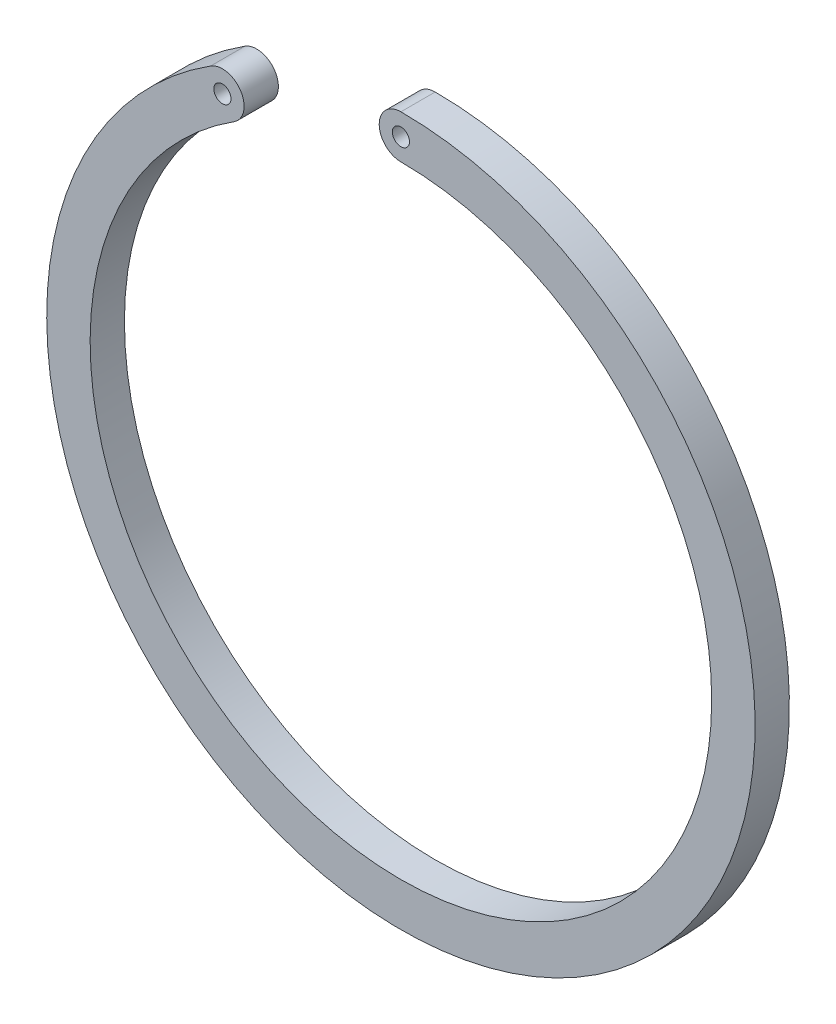
ISO-10303-21;
HEADER;
FILE_DESCRIPTION(('STEP AP214'),'2;1');
FILE_NAME('part.step','',(''),(''),'','','');
FILE_SCHEMA(('AUTOMOTIVE_DESIGN { 1 0 10303 214 1 1 1 1 }'));
ENDSEC;
DATA;
#1=APPLICATION_CONTEXT('core data for automotive mechanical design processes');
#2=APPLICATION_PROTOCOL_DEFINITION('international standard','automotive_design',2000,#1);
#3=PRODUCT_CONTEXT('',#1,'mechanical');
#4=PRODUCT('Part','Part','',(#3));
#5=PRODUCT_RELATED_PRODUCT_CATEGORY('part','',(#4));
#6=PRODUCT_DEFINITION_FORMATION('','',#4);
#7=PRODUCT_DEFINITION_CONTEXT('part definition',#1,'design');
#8=PRODUCT_DEFINITION('design','',#6,#7);
#9=PRODUCT_DEFINITION_SHAPE('','',#8);
#10=(LENGTH_UNIT() NAMED_UNIT(*) SI_UNIT(.MILLI.,.METRE.));
#11=(NAMED_UNIT(*) PLANE_ANGLE_UNIT() SI_UNIT($,.RADIAN.));
#12=(NAMED_UNIT(*) SI_UNIT($,.STERADIAN.) SOLID_ANGLE_UNIT());
#13=UNCERTAINTY_MEASURE_WITH_UNIT(LENGTH_MEASURE(1.E-05),#10,'distance_accuracy_value','');
#14=(GEOMETRIC_REPRESENTATION_CONTEXT(3) GLOBAL_UNCERTAINTY_ASSIGNED_CONTEXT((#13)) GLOBAL_UNIT_ASSIGNED_CONTEXT((#10,
#11,#12)) REPRESENTATION_CONTEXT('',''));
#15=CARTESIAN_POINT('',(0.,0.,0.));
#16=DIRECTION('',(0.,0.,1.));
#17=DIRECTION('',(1.,0.,0.));
#18=AXIS2_PLACEMENT_3D('',#15,#16,#17);
#19=CARTESIAN_POINT('',(0.,0.,3.));
#20=DIRECTION('',(0.,0.,-1.));
#21=DIRECTION('',(-1.,0.,0.));
#22=AXIS2_PLACEMENT_3D('',#19,#20,#21);
#23=CYLINDRICAL_SURFACE('',#22,27.2);
#24=CARTESIAN_POINT('',(0.,0.,0.));
#25=DIRECTION('',(0.,0.,1.));
#26=DIRECTION('',(1.,0.,0.));
#27=AXIS2_PLACEMENT_3D('',#24,#25,#26);
#28=CIRCLE('',#27,27.2);
#29=CARTESIAN_POINT('',(-14.6041338397434,22.946879412915,0.));
#30=VERTEX_POINT('',#29);
#31=CARTESIAN_POINT('',(0.,27.2,0.));
#32=VERTEX_POINT('',#31);
#33=EDGE_CURVE('E110',#30,#32,#28,.T.);
#34=ORIENTED_EDGE('',*,*,#33,.F.);
#35=DIRECTION('',(0.,0.,-1.));
#36=VECTOR('',#35,1.);
#37=CARTESIAN_POINT('',(-14.6041338397434,22.946879412915,3.));
#38=LINE('',#37,#36);
#39=CARTESIAN_POINT('',(-14.6041338397434,22.946879412915,3.));
#40=VERTEX_POINT('',#39);
#41=EDGE_CURVE('E11',#40,#30,#38,.T.);
#42=ORIENTED_EDGE('',*,*,#41,.F.);
#43=CARTESIAN_POINT('',(0.,0.,3.));
#44=DIRECTION('',(0.,0.,1.));
#45=DIRECTION('',(1.,0.,0.));
#46=AXIS2_PLACEMENT_3D('',#43,#44,#45);
#47=CIRCLE('',#46,27.2);
#48=CARTESIAN_POINT('',(0.,27.2,3.));
#49=VERTEX_POINT('',#48);
#50=EDGE_CURVE('E94',#40,#49,#47,.T.);
#51=ORIENTED_EDGE('',*,*,#50,.T.);
#52=DIRECTION('',(0.,0.,-1.));
#53=VECTOR('',#52,1.);
#54=CARTESIAN_POINT('',(0.,27.2,3.));
#55=LINE('',#54,#53);
#56=EDGE_CURVE('E56',#49,#32,#55,.T.);
#57=ORIENTED_EDGE('',*,*,#56,.T.);
#58=EDGE_LOOP('',(#34,#42,#51,#57));
#59=FACE_BOUND('',#58,.T.);
#60=ADVANCED_FACE('F39',(#59),#23,.F.);
#61=CARTESIAN_POINT('',(-15.6242755417843,24.5497864307289,3.));
#62=DIRECTION('',(0.,0.,-1.));
#63=DIRECTION('',(-1.,0.,0.));
#64=AXIS2_PLACEMENT_3D('',#61,#62,#63);
#65=CYLINDRICAL_SURFACE('',#64,1.9);
#66=CARTESIAN_POINT('',(-15.6242755417843,24.5497864307289,0.));
#67=DIRECTION('',(0.,0.,1.));
#68=DIRECTION('',(1.,0.,0.));
#69=AXIS2_PLACEMENT_3D('',#66,#67,#68);
#70=CIRCLE('',#69,1.9);
#71=CARTESIAN_POINT('',(-16.6444172438252,26.1526934485428,0.));
#72=VERTEX_POINT('',#71);
#73=EDGE_CURVE('E99',#30,#72,#70,.T.);
#74=ORIENTED_EDGE('',*,*,#73,.T.);
#75=DIRECTION('',(0.,0.,-1.));
#76=VECTOR('',#75,1.);
#77=CARTESIAN_POINT('',(-16.6444172438252,26.1526934485428,3.));
#78=LINE('',#77,#76);
#79=CARTESIAN_POINT('',(-16.6444172438252,26.1526934485428,3.));
#80=VERTEX_POINT('',#79);
#81=EDGE_CURVE('E48',#80,#72,#78,.T.);
#82=ORIENTED_EDGE('',*,*,#81,.F.);
#83=CARTESIAN_POINT('',(-15.6242755417843,24.5497864307289,3.));
#84=DIRECTION('',(0.,0.,1.));
#85=DIRECTION('',(1.,0.,0.));
#86=AXIS2_PLACEMENT_3D('',#83,#84,#85);
#87=CIRCLE('',#86,1.9);
#88=EDGE_CURVE('E90',#40,#80,#87,.T.);
#89=ORIENTED_EDGE('',*,*,#88,.F.);
#90=ORIENTED_EDGE('',*,*,#41,.T.);
#91=EDGE_LOOP('',(#74,#82,#89,#90));
#92=FACE_BOUND('',#91,.T.);
#93=ADVANCED_FACE('F97',(#92),#65,.T.);
#94=CARTESIAN_POINT('',(0.,0.,3.));
#95=DIRECTION('',(0.,0.,-1.));
#96=DIRECTION('',(-1.,0.,0.));
#97=AXIS2_PLACEMENT_3D('',#94,#95,#96);
#98=CYLINDRICAL_SURFACE('',#97,31.);
#99=CARTESIAN_POINT('',(0.,0.,0.));
#100=DIRECTION('',(0.,0.,1.));
#101=DIRECTION('',(1.,0.,0.));
#102=AXIS2_PLACEMENT_3D('',#99,#100,#101);
#103=CIRCLE('',#102,31.);
#104=CARTESIAN_POINT('',(0.,31.,0.));
#105=VERTEX_POINT('',#104);
#106=EDGE_CURVE('E107',#72,#105,#103,.T.);
#107=ORIENTED_EDGE('',*,*,#106,.T.);
#108=DIRECTION('',(0.,0.,-1.));
#109=VECTOR('',#108,1.);
#110=CARTESIAN_POINT('',(0.,31.,3.));
#111=LINE('',#110,#109);
#112=CARTESIAN_POINT('',(0.,31.,3.));
#113=VERTEX_POINT('',#112);
#114=EDGE_CURVE('E70',#113,#105,#111,.T.);
#115=ORIENTED_EDGE('',*,*,#114,.F.);
#116=CARTESIAN_POINT('',(0.,0.,3.));
#117=DIRECTION('',(0.,0.,1.));
#118=DIRECTION('',(1.,0.,0.));
#119=AXIS2_PLACEMENT_3D('',#116,#117,#118);
#120=CIRCLE('',#119,31.);
#121=EDGE_CURVE('E82',#80,#113,#120,.T.);
#122=ORIENTED_EDGE('',*,*,#121,.F.);
#123=ORIENTED_EDGE('',*,*,#81,.T.);
#124=EDGE_LOOP('',(#107,#115,#122,#123));
#125=FACE_BOUND('',#124,.T.);
#126=ADVANCED_FACE('F84',(#125),#98,.T.);
#127=CARTESIAN_POINT('',(-15.6242755417843,24.5497864307289,3.));
#128=DIRECTION('',(0.,0.,-1.));
#129=DIRECTION('',(-1.,0.,0.));
#130=AXIS2_PLACEMENT_3D('',#127,#128,#129);
#131=CYLINDRICAL_SURFACE('',#130,0.75);
#132=CARTESIAN_POINT('',(-15.6242755417843,24.5497864307289,3.));
#133=DIRECTION('',(0.,0.,1.));
#134=DIRECTION('',(1.,0.,0.));
#135=AXIS2_PLACEMENT_3D('',#132,#133,#134);
#136=CIRCLE('',#135,0.75);
#137=CARTESIAN_POINT('',(-14.8742755417843,24.5497864307289,3.));
#138=VERTEX_POINT('',#137);
#139=EDGE_CURVE('E120',#138,#138,#136,.T.);
#140=ORIENTED_EDGE('',*,*,#139,.T.);
#141=EDGE_LOOP('',(#140));
#142=FACE_BOUND('',#141,.T.);
#143=CARTESIAN_POINT('',(-15.6242755417843,24.5497864307289,0.));
#144=DIRECTION('',(0.,0.,1.));
#145=DIRECTION('',(1.,0.,0.));
#146=AXIS2_PLACEMENT_3D('',#143,#144,#145);
#147=CIRCLE('',#146,0.75);
#148=CARTESIAN_POINT('',(-14.8742755417843,24.5497864307289,0.));
#149=VERTEX_POINT('',#148);
#150=EDGE_CURVE('E112',#149,#149,#147,.T.);
#151=ORIENTED_EDGE('',*,*,#150,.F.);
#152=EDGE_LOOP('',(#151));
#153=FACE_BOUND('',#152,.T.);
#154=ADVANCED_FACE('F135',(#142,#153),#131,.F.);
#155=CARTESIAN_POINT('',(0.,29.1,3.));
#156=DIRECTION('',(0.,0.,-1.));
#157=DIRECTION('',(-1.,0.,0.));
#158=AXIS2_PLACEMENT_3D('',#155,#156,#157);
#159=CYLINDRICAL_SURFACE('',#158,0.750000000000001);
#160=CARTESIAN_POINT('',(0.,29.1,3.));
#161=DIRECTION('',(0.,0.,1.));
#162=DIRECTION('',(1.,0.,0.));
#163=AXIS2_PLACEMENT_3D('',#160,#161,#162);
#164=CIRCLE('',#163,0.750000000000001);
#165=CARTESIAN_POINT('',(0.750000000000001,29.1,3.));
#166=VERTEX_POINT('',#165);
#167=EDGE_CURVE('E106',#166,#166,#164,.T.);
#168=ORIENTED_EDGE('',*,*,#167,.T.);
#169=EDGE_LOOP('',(#168));
#170=FACE_BOUND('',#169,.T.);
#171=CARTESIAN_POINT('',(0.,29.1,0.));
#172=DIRECTION('',(0.,0.,1.));
#173=DIRECTION('',(1.,0.,0.));
#174=AXIS2_PLACEMENT_3D('',#171,#172,#173);
#175=CIRCLE('',#174,0.750000000000001);
#176=CARTESIAN_POINT('',(0.750000000000001,29.1,0.));
#177=VERTEX_POINT('',#176);
#178=EDGE_CURVE('E115',#177,#177,#175,.T.);
#179=ORIENTED_EDGE('',*,*,#178,.F.);
#180=EDGE_LOOP('',(#179));
#181=FACE_BOUND('',#180,.T.);
#182=ADVANCED_FACE('F41',(#170,#181),#159,.F.);
#183=CARTESIAN_POINT('',(0.,29.1,3.));
#184=DIRECTION('',(0.,0.,-1.));
#185=DIRECTION('',(-1.,0.,0.));
#186=AXIS2_PLACEMENT_3D('',#183,#184,#185);
#187=CYLINDRICAL_SURFACE('',#186,1.9);
#188=CARTESIAN_POINT('',(0.,29.1,0.));
#189=DIRECTION('',(0.,0.,1.));
#190=DIRECTION('',(1.,0.,0.));
#191=AXIS2_PLACEMENT_3D('',#188,#189,#190);
#192=CIRCLE('',#191,1.9);
#193=EDGE_CURVE('E103',#32,#105,#192,.F.);
#194=ORIENTED_EDGE('',*,*,#193,.F.);
#195=ORIENTED_EDGE('',*,*,#56,.F.);
#196=CARTESIAN_POINT('',(0.,29.1,3.));
#197=DIRECTION('',(0.,0.,1.));
#198=DIRECTION('',(1.,0.,0.));
#199=AXIS2_PLACEMENT_3D('',#196,#197,#198);
#200=CIRCLE('',#199,1.9);
#201=EDGE_CURVE('E89',#49,#113,#200,.F.);
#202=ORIENTED_EDGE('',*,*,#201,.T.);
#203=ORIENTED_EDGE('',*,*,#114,.T.);
#204=EDGE_LOOP('',(#194,#195,#202,#203));
#205=FACE_BOUND('',#204,.T.);
#206=ADVANCED_FACE('F131',(#205),#187,.T.);
#207=CARTESIAN_POINT('',(0.,0.,3.));
#208=DIRECTION('',(0.,0.,1.));
#209=DIRECTION('',(1.,0.,0.));
#210=AXIS2_PLACEMENT_3D('',#207,#208,#209);
#211=PLANE('',#210);
#212=ORIENTED_EDGE('',*,*,#167,.F.);
#213=EDGE_LOOP('',(#212));
#214=FACE_BOUND('',#213,.T.);
#215=ORIENTED_EDGE('',*,*,#139,.F.);
#216=EDGE_LOOP('',(#215));
#217=FACE_BOUND('',#216,.T.);
#218=ORIENTED_EDGE('',*,*,#50,.F.);
#219=ORIENTED_EDGE('',*,*,#88,.T.);
#220=ORIENTED_EDGE('',*,*,#121,.T.);
#221=ORIENTED_EDGE('',*,*,#201,.F.);
#222=EDGE_LOOP('',(#218,#219,#220,#221));
#223=FACE_BOUND('',#222,.T.);
#224=ADVANCED_FACE('F93',(#214,#217,#223),#211,.T.);
#225=CARTESIAN_POINT('',(0.,0.,0.));
#226=DIRECTION('',(0.,0.,1.));
#227=DIRECTION('',(1.,0.,0.));
#228=AXIS2_PLACEMENT_3D('',#225,#226,#227);
#229=PLANE('',#228);
#230=ORIENTED_EDGE('',*,*,#178,.T.);
#231=EDGE_LOOP('',(#230));
#232=FACE_BOUND('',#231,.T.);
#233=ORIENTED_EDGE('',*,*,#150,.T.);
#234=EDGE_LOOP('',(#233));
#235=FACE_BOUND('',#234,.T.);
#236=ORIENTED_EDGE('',*,*,#33,.T.);
#237=ORIENTED_EDGE('',*,*,#193,.T.);
#238=ORIENTED_EDGE('',*,*,#106,.F.);
#239=ORIENTED_EDGE('',*,*,#73,.F.);
#240=EDGE_LOOP('',(#236,#237,#238,#239));
#241=FACE_BOUND('',#240,.T.);
#242=ADVANCED_FACE('F130',(#232,#235,#241),#229,.F.);
#243=CLOSED_SHELL('',(#60,#93,#126,#154,#182,#206,#224,#242));
#244=MANIFOLD_SOLID_BREP('B2',#243);
#245=ADVANCED_BREP_SHAPE_REPRESENTATION('',(#18,#244),#14);
#246=SHAPE_DEFINITION_REPRESENTATION(#9,#245);
ENDSEC;
END-ISO-10303-21;
